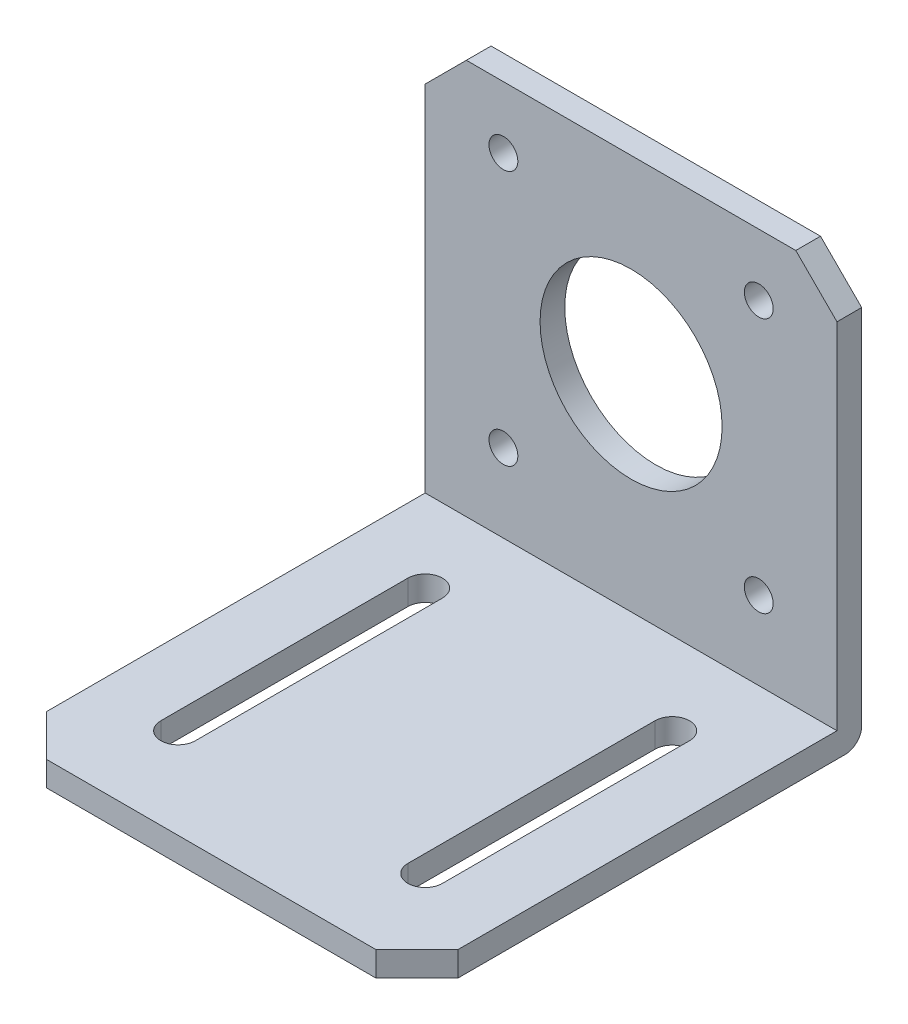
ISO-10303-21;
HEADER;
FILE_DESCRIPTION(('STEP AP214'),'2;1');
FILE_NAME('part.step','',(''),(''),'','','');
FILE_SCHEMA(('AUTOMOTIVE_DESIGN { 1 0 10303 214 1 1 1 1 }'));
ENDSEC;
DATA;
#1=APPLICATION_CONTEXT('core data for automotive mechanical design processes');
#2=APPLICATION_PROTOCOL_DEFINITION('international standard','automotive_design',2000,#1);
#3=PRODUCT_CONTEXT('',#1,'mechanical');
#4=PRODUCT('Part','Part','',(#3));
#5=PRODUCT_RELATED_PRODUCT_CATEGORY('part','',(#4));
#6=PRODUCT_DEFINITION_FORMATION('','',#4);
#7=PRODUCT_DEFINITION_CONTEXT('part definition',#1,'design');
#8=PRODUCT_DEFINITION('design','',#6,#7);
#9=PRODUCT_DEFINITION_SHAPE('','',#8);
#10=(LENGTH_UNIT() NAMED_UNIT(*) SI_UNIT(.MILLI.,.METRE.));
#11=(NAMED_UNIT(*) PLANE_ANGLE_UNIT() SI_UNIT($,.RADIAN.));
#12=(NAMED_UNIT(*) SI_UNIT($,.STERADIAN.) SOLID_ANGLE_UNIT());
#13=UNCERTAINTY_MEASURE_WITH_UNIT(LENGTH_MEASURE(1.E-05),#10,'distance_accuracy_value','');
#14=(GEOMETRIC_REPRESENTATION_CONTEXT(3) GLOBAL_UNCERTAINTY_ASSIGNED_CONTEXT((#13)) GLOBAL_UNIT_ASSIGNED_CONTEXT((#10,
#11,#12)) REPRESENTATION_CONTEXT('',''));
#15=CARTESIAN_POINT('',(0.,0.,0.));
#16=DIRECTION('',(0.,0.,1.));
#17=DIRECTION('',(1.,0.,0.));
#18=AXIS2_PLACEMENT_3D('',#15,#16,#17);
#19=CARTESIAN_POINT('',(0.,0.,3.));
#20=DIRECTION('',(0.,0.,-1.));
#21=DIRECTION('',(-1.,0.,0.));
#22=AXIS2_PLACEMENT_3D('',#19,#20,#21);
#23=PLANE('',#22);
#24=CARTESIAN_POINT('',(0.,11.7086800216875,3.));
#25=DIRECTION('',(0.,0.,1.));
#26=DIRECTION('',(1.,0.,0.));
#27=AXIS2_PLACEMENT_3D('',#24,#25,#26);
#28=CIRCLE('',#27,11.05);
#29=CARTESIAN_POINT('',(11.05,11.7086800216875,3.));
#30=VERTEX_POINT('',#29);
#31=EDGE_CURVE('E256',#30,#30,#28,.T.);
#32=ORIENTED_EDGE('',*,*,#31,.F.);
#33=EDGE_LOOP('',(#32));
#34=FACE_BOUND('',#33,.T.);
#35=CARTESIAN_POINT('',(15.5,-3.79131997831251,3.));
#36=DIRECTION('',(0.,0.,1.));
#37=DIRECTION('',(1.,0.,0.));
#38=AXIS2_PLACEMENT_3D('',#35,#36,#37);
#39=CIRCLE('',#38,1.75);
#40=CARTESIAN_POINT('',(17.25,-3.79131997831251,3.));
#41=VERTEX_POINT('',#40);
#42=EDGE_CURVE('E262',#41,#41,#39,.T.);
#43=ORIENTED_EDGE('',*,*,#42,.F.);
#44=EDGE_LOOP('',(#43));
#45=FACE_BOUND('',#44,.T.);
#46=CARTESIAN_POINT('',(-15.5,-3.79131997831251,3.));
#47=DIRECTION('',(0.,0.,1.));
#48=DIRECTION('',(1.,0.,0.));
#49=AXIS2_PLACEMENT_3D('',#46,#47,#48);
#50=CIRCLE('',#49,1.75);
#51=CARTESIAN_POINT('',(-13.75,-3.79131997831251,3.));
#52=VERTEX_POINT('',#51);
#53=EDGE_CURVE('E268',#52,#52,#50,.T.);
#54=ORIENTED_EDGE('',*,*,#53,.F.);
#55=EDGE_LOOP('',(#54));
#56=FACE_BOUND('',#55,.T.);
#57=CARTESIAN_POINT('',(15.5,27.2086800216875,3.));
#58=DIRECTION('',(0.,0.,1.));
#59=DIRECTION('',(1.,0.,0.));
#60=AXIS2_PLACEMENT_3D('',#57,#58,#59);
#61=CIRCLE('',#60,1.75);
#62=CARTESIAN_POINT('',(17.25,27.2086800216875,3.));
#63=VERTEX_POINT('',#62);
#64=EDGE_CURVE('E274',#63,#63,#61,.T.);
#65=ORIENTED_EDGE('',*,*,#64,.F.);
#66=EDGE_LOOP('',(#65));
#67=FACE_BOUND('',#66,.T.);
#68=CARTESIAN_POINT('',(-15.5,27.2086800216875,3.));
#69=DIRECTION('',(0.,0.,1.));
#70=DIRECTION('',(1.,0.,0.));
#71=AXIS2_PLACEMENT_3D('',#68,#69,#70);
#72=CIRCLE('',#71,1.75);
#73=CARTESIAN_POINT('',(-13.75,27.2086800216875,3.));
#74=VERTEX_POINT('',#73);
#75=EDGE_CURVE('E280',#74,#74,#72,.T.);
#76=ORIENTED_EDGE('',*,*,#75,.F.);
#77=EDGE_LOOP('',(#76));
#78=FACE_BOUND('',#77,.T.);
#79=DIRECTION('',(-1.,0.,0.));
#80=VECTOR('',#79,1.);
#81=CARTESIAN_POINT('',(-25.,-13.2913199783125,3.));
#82=LINE('',#81,#80);
#83=CARTESIAN_POINT('',(25.,-13.2913199783125,3.));
#84=VERTEX_POINT('',#83);
#85=CARTESIAN_POINT('',(-25.,-13.2913199783125,3.));
#86=VERTEX_POINT('',#85);
#87=EDGE_CURVE('E242',#84,#86,#82,.T.);
#88=ORIENTED_EDGE('',*,*,#87,.F.);
#89=DIRECTION('',(0.,1.,0.));
#90=VECTOR('',#89,1.);
#91=CARTESIAN_POINT('',(25.,29.7086800216875,3.));
#92=LINE('',#91,#90);
#93=CARTESIAN_POINT('',(25.,29.7086800216875,3.));
#94=VERTEX_POINT('',#93);
#95=EDGE_CURVE('E286',#84,#94,#92,.T.);
#96=ORIENTED_EDGE('',*,*,#95,.T.);
#97=DIRECTION('',(-0.707106781186547,0.707106781186548,0.));
#98=VECTOR('',#97,1.);
#99=CARTESIAN_POINT('',(20.,34.7086800216875,3.));
#100=LINE('',#99,#98);
#101=CARTESIAN_POINT('',(20.,34.7086800216875,3.));
#102=VERTEX_POINT('',#101);
#103=EDGE_CURVE('E288',#94,#102,#100,.T.);
#104=ORIENTED_EDGE('',*,*,#103,.T.);
#105=DIRECTION('',(-1.,0.,0.));
#106=VECTOR('',#105,1.);
#107=CARTESIAN_POINT('',(-20.,34.7086800216875,3.));
#108=LINE('',#107,#106);
#109=CARTESIAN_POINT('',(-20.,34.7086800216875,3.));
#110=VERTEX_POINT('',#109);
#111=EDGE_CURVE('E291',#102,#110,#108,.T.);
#112=ORIENTED_EDGE('',*,*,#111,.T.);
#113=DIRECTION('',(-0.707106781186548,-0.707106781186548,0.));
#114=VECTOR('',#113,1.);
#115=CARTESIAN_POINT('',(-25.,29.7086800216875,3.));
#116=LINE('',#115,#114);
#117=CARTESIAN_POINT('',(-25.,29.7086800216875,3.));
#118=VERTEX_POINT('',#117);
#119=EDGE_CURVE('E293',#110,#118,#116,.T.);
#120=ORIENTED_EDGE('',*,*,#119,.T.);
#121=DIRECTION('',(0.,-1.,0.));
#122=VECTOR('',#121,1.);
#123=CARTESIAN_POINT('',(-25.,-16.2913199783125,3.));
#124=LINE('',#123,#122);
#125=EDGE_CURVE('E295',#118,#86,#124,.T.);
#126=ORIENTED_EDGE('',*,*,#125,.T.);
#127=EDGE_LOOP('',(#88,#96,#104,#112,#120,#126));
#128=FACE_BOUND('',#127,.T.);
#129=ADVANCED_FACE('F35',(#34,#45,#56,#67,#78,#128),#23,.F.);
#130=CARTESIAN_POINT('',(0.,0.,0.));
#131=DIRECTION('',(0.,0.,-1.));
#132=DIRECTION('',(-1.,0.,0.));
#133=AXIS2_PLACEMENT_3D('',#130,#131,#132);
#134=PLANE('',#133);
#135=CARTESIAN_POINT('',(15.5,-3.79131997831251,0.));
#136=DIRECTION('',(0.,0.,1.));
#137=DIRECTION('',(1.,0.,0.));
#138=AXIS2_PLACEMENT_3D('',#135,#136,#137);
#139=CIRCLE('',#138,1.75);
#140=CARTESIAN_POINT('',(17.25,-3.79131997831251,0.));
#141=VERTEX_POINT('',#140);
#142=EDGE_CURVE('E259',#141,#141,#139,.T.);
#143=ORIENTED_EDGE('',*,*,#142,.T.);
#144=EDGE_LOOP('',(#143));
#145=FACE_BOUND('',#144,.T.);
#146=CARTESIAN_POINT('',(15.5,27.2086800216875,0.));
#147=DIRECTION('',(0.,0.,1.));
#148=DIRECTION('',(1.,0.,0.));
#149=AXIS2_PLACEMENT_3D('',#146,#147,#148);
#150=CIRCLE('',#149,1.75);
#151=CARTESIAN_POINT('',(17.25,27.2086800216875,0.));
#152=VERTEX_POINT('',#151);
#153=EDGE_CURVE('E271',#152,#152,#150,.T.);
#154=ORIENTED_EDGE('',*,*,#153,.T.);
#155=EDGE_LOOP('',(#154));
#156=FACE_BOUND('',#155,.T.);
#157=DIRECTION('',(0.,1.,0.));
#158=VECTOR('',#157,1.);
#159=CARTESIAN_POINT('',(25.,29.7086800216875,0.));
#160=LINE('',#159,#158);
#161=CARTESIAN_POINT('',(25.,-14.2913199783125,0.));
#162=VERTEX_POINT('',#161);
#163=CARTESIAN_POINT('',(25.,29.7086800216875,0.));
#164=VERTEX_POINT('',#163);
#165=EDGE_CURVE('E283',#162,#164,#160,.T.);
#166=ORIENTED_EDGE('',*,*,#165,.F.);
#167=DIRECTION('',(1.,0.,0.));
#168=VECTOR('',#167,1.);
#169=CARTESIAN_POINT('',(-25.,-14.2913199783125,0.));
#170=LINE('',#169,#168);
#171=CARTESIAN_POINT('',(-25.,-14.2913199783125,0.));
#172=VERTEX_POINT('',#171);
#173=EDGE_CURVE('E328',#162,#172,#170,.F.);
#174=ORIENTED_EDGE('',*,*,#173,.T.);
#175=DIRECTION('',(0.,-1.,0.));
#176=VECTOR('',#175,1.);
#177=CARTESIAN_POINT('',(-25.,-16.2913199783125,0.));
#178=LINE('',#177,#176);
#179=CARTESIAN_POINT('',(-25.,29.7086800216875,0.));
#180=VERTEX_POINT('',#179);
#181=EDGE_CURVE('E289',#180,#172,#178,.T.);
#182=ORIENTED_EDGE('',*,*,#181,.F.);
#183=DIRECTION('',(-0.707106781186548,-0.707106781186548,0.));
#184=VECTOR('',#183,1.);
#185=CARTESIAN_POINT('',(-25.,29.7086800216875,0.));
#186=LINE('',#185,#184);
#187=CARTESIAN_POINT('',(-20.,34.7086800216875,0.));
#188=VERTEX_POINT('',#187);
#189=EDGE_CURVE('E304',#188,#180,#186,.T.);
#190=ORIENTED_EDGE('',*,*,#189,.F.);
#191=DIRECTION('',(-1.,0.,0.));
#192=VECTOR('',#191,1.);
#193=CARTESIAN_POINT('',(-20.,34.7086800216875,0.));
#194=LINE('',#193,#192);
#195=CARTESIAN_POINT('',(20.,34.7086800216875,0.));
#196=VERTEX_POINT('',#195);
#197=EDGE_CURVE('E302',#196,#188,#194,.T.);
#198=ORIENTED_EDGE('',*,*,#197,.F.);
#199=DIRECTION('',(-0.707106781186547,0.707106781186548,0.));
#200=VECTOR('',#199,1.);
#201=CARTESIAN_POINT('',(20.,34.7086800216875,0.));
#202=LINE('',#201,#200);
#203=EDGE_CURVE('E300',#164,#196,#202,.T.);
#204=ORIENTED_EDGE('',*,*,#203,.F.);
#205=EDGE_LOOP('',(#166,#174,#182,#190,#198,#204));
#206=FACE_BOUND('',#205,.T.);
#207=CARTESIAN_POINT('',(-15.5,27.2086800216875,0.));
#208=DIRECTION('',(0.,0.,1.));
#209=DIRECTION('',(1.,0.,0.));
#210=AXIS2_PLACEMENT_3D('',#207,#208,#209);
#211=CIRCLE('',#210,1.75);
#212=CARTESIAN_POINT('',(-13.75,27.2086800216875,0.));
#213=VERTEX_POINT('',#212);
#214=EDGE_CURVE('E277',#213,#213,#211,.T.);
#215=ORIENTED_EDGE('',*,*,#214,.T.);
#216=EDGE_LOOP('',(#215));
#217=FACE_BOUND('',#216,.T.);
#218=CARTESIAN_POINT('',(-15.5,-3.79131997831251,0.));
#219=DIRECTION('',(0.,0.,1.));
#220=DIRECTION('',(1.,0.,0.));
#221=AXIS2_PLACEMENT_3D('',#218,#219,#220);
#222=CIRCLE('',#221,1.75);
#223=CARTESIAN_POINT('',(-13.75,-3.79131997831251,0.));
#224=VERTEX_POINT('',#223);
#225=EDGE_CURVE('E265',#224,#224,#222,.T.);
#226=ORIENTED_EDGE('',*,*,#225,.T.);
#227=EDGE_LOOP('',(#226));
#228=FACE_BOUND('',#227,.T.);
#229=CARTESIAN_POINT('',(0.,11.7086800216875,0.));
#230=DIRECTION('',(0.,0.,1.));
#231=DIRECTION('',(1.,0.,0.));
#232=AXIS2_PLACEMENT_3D('',#229,#230,#231);
#233=CIRCLE('',#232,11.05);
#234=CARTESIAN_POINT('',(11.05,11.7086800216875,0.));
#235=VERTEX_POINT('',#234);
#236=EDGE_CURVE('E255',#235,#235,#233,.T.);
#237=ORIENTED_EDGE('',*,*,#236,.T.);
#238=EDGE_LOOP('',(#237));
#239=FACE_BOUND('',#238,.T.);
#240=ADVANCED_FACE('F379',(#145,#156,#206,#217,#228,#239),#134,.T.);
#241=CARTESIAN_POINT('',(25.,-16.2913199783125,3.));
#242=DIRECTION('',(0.,1.,0.));
#243=DIRECTION('',(-1.,0.,0.));
#244=AXIS2_PLACEMENT_3D('',#241,#242,#243);
#245=PLANE('',#244);
#246=DIRECTION('',(0.,0.,-1.));
#247=VECTOR('',#246,1.);
#248=CARTESIAN_POINT('',(17.1,-16.2913199783125,3.));
#249=LINE('',#248,#247);
#250=CARTESIAN_POINT('',(17.1,-16.2913199783125,43.));
#251=VERTEX_POINT('',#250);
#252=CARTESIAN_POINT('',(17.1,-16.2913199783125,13.));
#253=VERTEX_POINT('',#252);
#254=EDGE_CURVE('E204',#251,#253,#249,.T.);
#255=ORIENTED_EDGE('',*,*,#254,.T.);
#256=CARTESIAN_POINT('',(15.,-16.2913199783125,13.));
#257=DIRECTION('',(0.,1.,0.));
#258=DIRECTION('',(-1.,0.,0.));
#259=AXIS2_PLACEMENT_3D('',#256,#257,#258);
#260=CIRCLE('',#259,2.1);
#261=CARTESIAN_POINT('',(12.9,-16.2913199783125,13.));
#262=VERTEX_POINT('',#261);
#263=EDGE_CURVE('E207',#253,#262,#260,.T.);
#264=ORIENTED_EDGE('',*,*,#263,.T.);
#265=DIRECTION('',(0.,0.,1.));
#266=VECTOR('',#265,1.);
#267=CARTESIAN_POINT('',(12.9,-16.2913199783125,3.));
#268=LINE('',#267,#266);
#269=CARTESIAN_POINT('',(12.9,-16.2913199783125,43.));
#270=VERTEX_POINT('',#269);
#271=EDGE_CURVE('E199',#262,#270,#268,.T.);
#272=ORIENTED_EDGE('',*,*,#271,.T.);
#273=CARTESIAN_POINT('',(15.,-16.2913199783125,43.));
#274=DIRECTION('',(0.,1.,0.));
#275=DIRECTION('',(-1.,0.,0.));
#276=AXIS2_PLACEMENT_3D('',#273,#274,#275);
#277=CIRCLE('',#276,2.1);
#278=EDGE_CURVE('E174',#270,#251,#277,.T.);
#279=ORIENTED_EDGE('',*,*,#278,.T.);
#280=EDGE_LOOP('',(#255,#264,#272,#279));
#281=FACE_BOUND('',#280,.T.);
#282=DIRECTION('',(0.,0.,-1.));
#283=VECTOR('',#282,1.);
#284=CARTESIAN_POINT('',(-12.9,-16.2913199783125,2.99999999999999));
#285=LINE('',#284,#283);
#286=CARTESIAN_POINT('',(-12.9,-16.2913199783125,43.));
#287=VERTEX_POINT('',#286);
#288=CARTESIAN_POINT('',(-12.9,-16.2913199783125,13.));
#289=VERTEX_POINT('',#288);
#290=EDGE_CURVE('E236',#287,#289,#285,.T.);
#291=ORIENTED_EDGE('',*,*,#290,.T.);
#292=CARTESIAN_POINT('',(-15.,-16.2913199783125,13.));
#293=DIRECTION('',(0.,1.,0.));
#294=DIRECTION('',(-1.,0.,0.));
#295=AXIS2_PLACEMENT_3D('',#292,#293,#294);
#296=CIRCLE('',#295,2.1);
#297=CARTESIAN_POINT('',(-17.1,-16.2913199783125,13.));
#298=VERTEX_POINT('',#297);
#299=EDGE_CURVE('E239',#289,#298,#296,.T.);
#300=ORIENTED_EDGE('',*,*,#299,.T.);
#301=DIRECTION('',(0.,0.,1.));
#302=VECTOR('',#301,1.);
#303=CARTESIAN_POINT('',(-17.1,-16.2913199783125,2.99999999999999));
#304=LINE('',#303,#302);
#305=CARTESIAN_POINT('',(-17.1,-16.2913199783125,43.));
#306=VERTEX_POINT('',#305);
#307=EDGE_CURVE('E224',#298,#306,#304,.T.);
#308=ORIENTED_EDGE('',*,*,#307,.T.);
#309=CARTESIAN_POINT('',(-15.,-16.2913199783125,43.));
#310=DIRECTION('',(0.,1.,0.));
#311=DIRECTION('',(-1.,0.,0.));
#312=AXIS2_PLACEMENT_3D('',#309,#310,#311);
#313=CIRCLE('',#312,2.1);
#314=EDGE_CURVE('E233',#306,#287,#313,.T.);
#315=ORIENTED_EDGE('',*,*,#314,.T.);
#316=EDGE_LOOP('',(#291,#300,#308,#315));
#317=FACE_BOUND('',#316,.T.);
#318=DIRECTION('',(1.,0.,0.));
#319=VECTOR('',#318,1.);
#320=CARTESIAN_POINT('',(-25.,-16.2913199783125,54.));
#321=LINE('',#320,#319);
#322=CARTESIAN_POINT('',(-20.,-16.2913199783125,54.));
#323=VERTEX_POINT('',#322);
#324=CARTESIAN_POINT('',(20.,-16.2913199783125,54.));
#325=VERTEX_POINT('',#324);
#326=EDGE_CURVE('E243',#323,#325,#321,.T.);
#327=ORIENTED_EDGE('',*,*,#326,.F.);
#328=DIRECTION('',(-0.707106781186546,0.,-0.70710678118655));
#329=VECTOR('',#328,1.);
#330=CARTESIAN_POINT('',(-20.,-16.2913199783125,54.));
#331=LINE('',#330,#329);
#332=CARTESIAN_POINT('',(-25.,-16.2913199783125,49.));
#333=VERTEX_POINT('',#332);
#334=EDGE_CURVE('E341',#323,#333,#331,.T.);
#335=ORIENTED_EDGE('',*,*,#334,.T.);
#336=DIRECTION('',(0.,0.,-1.));
#337=VECTOR('',#336,1.);
#338=CARTESIAN_POINT('',(-25.,-16.2913199783125,3.));
#339=LINE('',#338,#337);
#340=CARTESIAN_POINT('',(-25.,-16.2913199783125,2.));
#341=VERTEX_POINT('',#340);
#342=EDGE_CURVE('E298',#333,#341,#339,.T.);
#343=ORIENTED_EDGE('',*,*,#342,.T.);
#344=DIRECTION('',(1.,0.,0.));
#345=VECTOR('',#344,1.);
#346=CARTESIAN_POINT('',(25.,-16.2913199783125,2.));
#347=LINE('',#346,#345);
#348=CARTESIAN_POINT('',(25.,-16.2913199783125,2.));
#349=VERTEX_POINT('',#348);
#350=EDGE_CURVE('E323',#341,#349,#347,.T.);
#351=ORIENTED_EDGE('',*,*,#350,.T.);
#352=DIRECTION('',(0.,0.,-1.));
#353=VECTOR('',#352,1.);
#354=CARTESIAN_POINT('',(25.,-16.2913199783125,3.));
#355=LINE('',#354,#353);
#356=CARTESIAN_POINT('',(25.,-16.2913199783125,49.));
#357=VERTEX_POINT('',#356);
#358=EDGE_CURVE('E321',#357,#349,#355,.T.);
#359=ORIENTED_EDGE('',*,*,#358,.F.);
#360=DIRECTION('',(-0.707106781186546,0.,0.707106781186549));
#361=VECTOR('',#360,1.);
#362=CARTESIAN_POINT('',(20.,-16.2913199783125,54.));
#363=LINE('',#362,#361);
#364=EDGE_CURVE('E339',#357,#325,#363,.T.);
#365=ORIENTED_EDGE('',*,*,#364,.T.);
#366=EDGE_LOOP('',(#327,#335,#343,#351,#359,#365));
#367=FACE_BOUND('',#366,.T.);
#368=ADVANCED_FACE('F353',(#281,#317,#367),#245,.F.);
#369=CARTESIAN_POINT('',(25.,29.7086800216875,3.));
#370=DIRECTION('',(-1.,0.,0.));
#371=DIRECTION('',(0.,-1.,0.));
#372=AXIS2_PLACEMENT_3D('',#369,#370,#371);
#373=PLANE('',#372);
#374=DIRECTION('',(0.,0.,-1.));
#375=VECTOR('',#374,1.);
#376=CARTESIAN_POINT('',(25.,-13.2913199783125,54.));
#377=LINE('',#376,#375);
#378=CARTESIAN_POINT('',(25.,-13.2913199783125,49.));
#379=VERTEX_POINT('',#378);
#380=EDGE_CURVE('E253',#379,#84,#377,.T.);
#381=ORIENTED_EDGE('',*,*,#380,.F.);
#382=DIRECTION('',(0.,-1.,0.));
#383=VECTOR('',#382,1.);
#384=CARTESIAN_POINT('',(25.,-16.2913199783125,49.));
#385=LINE('',#384,#383);
#386=EDGE_CURVE('E11',#379,#357,#385,.T.);
#387=ORIENTED_EDGE('',*,*,#386,.T.);
#388=ORIENTED_EDGE('',*,*,#358,.T.);
#389=CARTESIAN_POINT('',(25.,-14.2913199783125,2.));
#390=DIRECTION('',(-1.,0.,0.));
#391=DIRECTION('',(0.,-1.,0.));
#392=AXIS2_PLACEMENT_3D('',#389,#390,#391);
#393=CIRCLE('',#392,2.);
#394=EDGE_CURVE('E326',#349,#162,#393,.F.);
#395=ORIENTED_EDGE('',*,*,#394,.T.);
#396=ORIENTED_EDGE('',*,*,#165,.T.);
#397=DIRECTION('',(0.,0.,-1.));
#398=VECTOR('',#397,1.);
#399=CARTESIAN_POINT('',(25.,29.7086800216875,3.));
#400=LINE('',#399,#398);
#401=EDGE_CURVE('E318',#94,#164,#400,.T.);
#402=ORIENTED_EDGE('',*,*,#401,.F.);
#403=ORIENTED_EDGE('',*,*,#95,.F.);
#404=EDGE_LOOP('',(#381,#387,#388,#395,#396,#402,#403));
#405=FACE_BOUND('',#404,.T.);
#406=ADVANCED_FACE('F367',(#405),#373,.F.);
#407=CARTESIAN_POINT('',(20.,34.7086800216875,3.));
#408=DIRECTION('',(-0.707106781186548,-0.707106781186547,0.));
#409=DIRECTION('',(0.707106781186547,-0.707106781186548,0.));
#410=AXIS2_PLACEMENT_3D('',#407,#408,#409);
#411=PLANE('',#410);
#412=ORIENTED_EDGE('',*,*,#203,.T.);
#413=DIRECTION('',(0.,0.,-1.));
#414=VECTOR('',#413,1.);
#415=CARTESIAN_POINT('',(20.,34.7086800216875,3.));
#416=LINE('',#415,#414);
#417=EDGE_CURVE('E315',#102,#196,#416,.T.);
#418=ORIENTED_EDGE('',*,*,#417,.F.);
#419=ORIENTED_EDGE('',*,*,#103,.F.);
#420=ORIENTED_EDGE('',*,*,#401,.T.);
#421=EDGE_LOOP('',(#412,#418,#419,#420));
#422=FACE_BOUND('',#421,.T.);
#423=ADVANCED_FACE('F385',(#422),#411,.F.);
#424=CARTESIAN_POINT('',(-20.,34.7086800216875,3.));
#425=DIRECTION('',(0.,-1.,0.));
#426=DIRECTION('',(1.,0.,0.));
#427=AXIS2_PLACEMENT_3D('',#424,#425,#426);
#428=PLANE('',#427);
#429=ORIENTED_EDGE('',*,*,#197,.T.);
#430=DIRECTION('',(0.,0.,-1.));
#431=VECTOR('',#430,1.);
#432=CARTESIAN_POINT('',(-20.,34.7086800216875,3.));
#433=LINE('',#432,#431);
#434=EDGE_CURVE('E312',#110,#188,#433,.T.);
#435=ORIENTED_EDGE('',*,*,#434,.F.);
#436=ORIENTED_EDGE('',*,*,#111,.F.);
#437=ORIENTED_EDGE('',*,*,#417,.T.);
#438=EDGE_LOOP('',(#429,#435,#436,#437));
#439=FACE_BOUND('',#438,.T.);
#440=ADVANCED_FACE('F390',(#439),#428,.F.);
#441=CARTESIAN_POINT('',(-25.,29.7086800216875,3.));
#442=DIRECTION('',(0.707106781186547,-0.707106781186547,0.));
#443=DIRECTION('',(0.707106781186548,0.707106781186548,0.));
#444=AXIS2_PLACEMENT_3D('',#441,#442,#443);
#445=PLANE('',#444);
#446=ORIENTED_EDGE('',*,*,#189,.T.);
#447=DIRECTION('',(0.,0.,-1.));
#448=VECTOR('',#447,1.);
#449=CARTESIAN_POINT('',(-25.,29.7086800216875,3.));
#450=LINE('',#449,#448);
#451=EDGE_CURVE('E309',#118,#180,#450,.T.);
#452=ORIENTED_EDGE('',*,*,#451,.F.);
#453=ORIENTED_EDGE('',*,*,#119,.F.);
#454=ORIENTED_EDGE('',*,*,#434,.T.);
#455=EDGE_LOOP('',(#446,#452,#453,#454));
#456=FACE_BOUND('',#455,.T.);
#457=ADVANCED_FACE('F391',(#456),#445,.F.);
#458=CARTESIAN_POINT('',(-25.,-16.2913199783125,3.));
#459=DIRECTION('',(1.,0.,0.));
#460=DIRECTION('',(0.,1.,0.));
#461=AXIS2_PLACEMENT_3D('',#458,#459,#460);
#462=PLANE('',#461);
#463=ORIENTED_EDGE('',*,*,#342,.F.);
#464=DIRECTION('',(0.,1.,0.));
#465=VECTOR('',#464,1.);
#466=CARTESIAN_POINT('',(-25.,-13.2913199783125,49.));
#467=LINE('',#466,#465);
#468=CARTESIAN_POINT('',(-25.,-13.2913199783125,49.));
#469=VERTEX_POINT('',#468);
#470=EDGE_CURVE('E58',#333,#469,#467,.T.);
#471=ORIENTED_EDGE('',*,*,#470,.T.);
#472=DIRECTION('',(0.,0.,-1.));
#473=VECTOR('',#472,1.);
#474=CARTESIAN_POINT('',(-25.,-13.2913199783125,54.));
#475=LINE('',#474,#473);
#476=EDGE_CURVE('E249',#469,#86,#475,.T.);
#477=ORIENTED_EDGE('',*,*,#476,.T.);
#478=ORIENTED_EDGE('',*,*,#125,.F.);
#479=ORIENTED_EDGE('',*,*,#451,.T.);
#480=ORIENTED_EDGE('',*,*,#181,.T.);
#481=CARTESIAN_POINT('',(-25.,-14.2913199783125,2.));
#482=DIRECTION('',(1.,0.,0.));
#483=DIRECTION('',(0.,1.,0.));
#484=AXIS2_PLACEMENT_3D('',#481,#482,#483);
#485=CIRCLE('',#484,2.);
#486=EDGE_CURVE('E330',#172,#341,#485,.F.);
#487=ORIENTED_EDGE('',*,*,#486,.T.);
#488=EDGE_LOOP('',(#463,#471,#477,#478,#479,#480,#487));
#489=FACE_BOUND('',#488,.T.);
#490=ADVANCED_FACE('F354',(#489),#462,.F.);
#491=CARTESIAN_POINT('',(-15.5,27.2086800216875,3.));
#492=DIRECTION('',(0.,0.,-1.));
#493=DIRECTION('',(-1.,0.,0.));
#494=AXIS2_PLACEMENT_3D('',#491,#492,#493);
#495=CYLINDRICAL_SURFACE('',#494,1.75);
#496=ORIENTED_EDGE('',*,*,#75,.T.);
#497=EDGE_LOOP('',(#496));
#498=FACE_BOUND('',#497,.T.);
#499=ORIENTED_EDGE('',*,*,#214,.F.);
#500=EDGE_LOOP('',(#499));
#501=FACE_BOUND('',#500,.T.);
#502=ADVANCED_FACE('F398',(#498,#501),#495,.F.);
#503=CARTESIAN_POINT('',(15.5,27.2086800216875,3.));
#504=DIRECTION('',(0.,0.,-1.));
#505=DIRECTION('',(-1.,0.,0.));
#506=AXIS2_PLACEMENT_3D('',#503,#504,#505);
#507=CYLINDRICAL_SURFACE('',#506,1.75);
#508=ORIENTED_EDGE('',*,*,#64,.T.);
#509=EDGE_LOOP('',(#508));
#510=FACE_BOUND('',#509,.T.);
#511=ORIENTED_EDGE('',*,*,#153,.F.);
#512=EDGE_LOOP('',(#511));
#513=FACE_BOUND('',#512,.T.);
#514=ADVANCED_FACE('F414',(#510,#513),#507,.F.);
#515=CARTESIAN_POINT('',(-15.5,-3.79131997831251,3.));
#516=DIRECTION('',(0.,0.,-1.));
#517=DIRECTION('',(-1.,0.,0.));
#518=AXIS2_PLACEMENT_3D('',#515,#516,#517);
#519=CYLINDRICAL_SURFACE('',#518,1.75);
#520=ORIENTED_EDGE('',*,*,#53,.T.);
#521=EDGE_LOOP('',(#520));
#522=FACE_BOUND('',#521,.T.);
#523=ORIENTED_EDGE('',*,*,#225,.F.);
#524=EDGE_LOOP('',(#523));
#525=FACE_BOUND('',#524,.T.);
#526=ADVANCED_FACE('F418',(#522,#525),#519,.F.);
#527=CARTESIAN_POINT('',(15.5,-3.79131997831251,3.));
#528=DIRECTION('',(0.,0.,-1.));
#529=DIRECTION('',(-1.,0.,0.));
#530=AXIS2_PLACEMENT_3D('',#527,#528,#529);
#531=CYLINDRICAL_SURFACE('',#530,1.75);
#532=ORIENTED_EDGE('',*,*,#42,.T.);
#533=EDGE_LOOP('',(#532));
#534=FACE_BOUND('',#533,.T.);
#535=ORIENTED_EDGE('',*,*,#142,.F.);
#536=EDGE_LOOP('',(#535));
#537=FACE_BOUND('',#536,.T.);
#538=ADVANCED_FACE('F422',(#534,#537),#531,.F.);
#539=CARTESIAN_POINT('',(0.,11.7086800216875,3.));
#540=DIRECTION('',(0.,0.,-1.));
#541=DIRECTION('',(-1.,0.,0.));
#542=AXIS2_PLACEMENT_3D('',#539,#540,#541);
#543=CYLINDRICAL_SURFACE('',#542,11.05);
#544=ORIENTED_EDGE('',*,*,#31,.T.);
#545=EDGE_LOOP('',(#544));
#546=FACE_BOUND('',#545,.T.);
#547=ORIENTED_EDGE('',*,*,#236,.F.);
#548=EDGE_LOOP('',(#547));
#549=FACE_BOUND('',#548,.T.);
#550=ADVANCED_FACE('F426',(#546,#549),#543,.F.);
#551=CARTESIAN_POINT('',(-25.,-13.2913199783125,54.));
#552=DIRECTION('',(0.,-1.,0.));
#553=DIRECTION('',(1.,0.,0.));
#554=AXIS2_PLACEMENT_3D('',#551,#552,#553);
#555=PLANE('',#554);
#556=DIRECTION('',(0.,0.,1.));
#557=VECTOR('',#556,1.);
#558=CARTESIAN_POINT('',(12.9,-13.2913199783125,13.));
#559=LINE('',#558,#557);
#560=CARTESIAN_POINT('',(12.9,-13.2913199783125,13.));
#561=VERTEX_POINT('',#560);
#562=CARTESIAN_POINT('',(12.9,-13.2913199783125,43.));
#563=VERTEX_POINT('',#562);
#564=EDGE_CURVE('E182',#561,#563,#559,.T.);
#565=ORIENTED_EDGE('',*,*,#564,.F.);
#566=CARTESIAN_POINT('',(15.,-13.2913199783125,13.));
#567=DIRECTION('',(0.,1.,0.));
#568=DIRECTION('',(0.,0.,1.));
#569=AXIS2_PLACEMENT_3D('',#566,#567,#568);
#570=CIRCLE('',#569,2.1);
#571=CARTESIAN_POINT('',(17.1,-13.2913199783125,13.));
#572=VERTEX_POINT('',#571);
#573=EDGE_CURVE('E187',#572,#561,#570,.T.);
#574=ORIENTED_EDGE('',*,*,#573,.F.);
#575=DIRECTION('',(0.,0.,-1.));
#576=VECTOR('',#575,1.);
#577=CARTESIAN_POINT('',(17.1,-13.2913199783125,13.));
#578=LINE('',#577,#576);
#579=CARTESIAN_POINT('',(17.1,-13.2913199783125,43.));
#580=VERTEX_POINT('',#579);
#581=EDGE_CURVE('E192',#580,#572,#578,.T.);
#582=ORIENTED_EDGE('',*,*,#581,.F.);
#583=CARTESIAN_POINT('',(15.,-13.2913199783125,43.));
#584=DIRECTION('',(0.,1.,0.));
#585=DIRECTION('',(0.,0.,1.));
#586=AXIS2_PLACEMENT_3D('',#583,#584,#585);
#587=CIRCLE('',#586,2.1);
#588=EDGE_CURVE('E171',#563,#580,#587,.T.);
#589=ORIENTED_EDGE('',*,*,#588,.F.);
#590=EDGE_LOOP('',(#565,#574,#582,#589));
#591=FACE_BOUND('',#590,.T.);
#592=DIRECTION('',(0.,0.,1.));
#593=VECTOR('',#592,1.);
#594=CARTESIAN_POINT('',(-17.1,-13.2913199783125,13.));
#595=LINE('',#594,#593);
#596=CARTESIAN_POINT('',(-17.1,-13.2913199783125,13.));
#597=VERTEX_POINT('',#596);
#598=CARTESIAN_POINT('',(-17.1,-13.2913199783125,43.));
#599=VERTEX_POINT('',#598);
#600=EDGE_CURVE('E212',#597,#599,#595,.T.);
#601=ORIENTED_EDGE('',*,*,#600,.F.);
#602=CARTESIAN_POINT('',(-15.,-13.2913199783125,13.));
#603=DIRECTION('',(0.,1.,0.));
#604=DIRECTION('',(0.,0.,1.));
#605=AXIS2_PLACEMENT_3D('',#602,#603,#604);
#606=CIRCLE('',#605,2.1);
#607=CARTESIAN_POINT('',(-12.9,-13.2913199783125,13.));
#608=VERTEX_POINT('',#607);
#609=EDGE_CURVE('E210',#608,#597,#606,.T.);
#610=ORIENTED_EDGE('',*,*,#609,.F.);
#611=DIRECTION('',(0.,0.,-1.));
#612=VECTOR('',#611,1.);
#613=CARTESIAN_POINT('',(-12.9,-13.2913199783125,43.));
#614=LINE('',#613,#612);
#615=CARTESIAN_POINT('',(-12.9,-13.2913199783125,43.));
#616=VERTEX_POINT('',#615);
#617=EDGE_CURVE('E218',#616,#608,#614,.T.);
#618=ORIENTED_EDGE('',*,*,#617,.F.);
#619=CARTESIAN_POINT('',(-15.,-13.2913199783125,43.));
#620=DIRECTION('',(0.,1.,0.));
#621=DIRECTION('',(0.,0.,1.));
#622=AXIS2_PLACEMENT_3D('',#619,#620,#621);
#623=CIRCLE('',#622,2.1);
#624=EDGE_CURVE('E215',#599,#616,#623,.T.);
#625=ORIENTED_EDGE('',*,*,#624,.F.);
#626=EDGE_LOOP('',(#601,#610,#618,#625));
#627=FACE_BOUND('',#626,.T.);
#628=ORIENTED_EDGE('',*,*,#476,.F.);
#629=DIRECTION('',(0.707106781186546,0.,0.70710678118655));
#630=VECTOR('',#629,1.);
#631=CARTESIAN_POINT('',(-20.,-13.2913199783125,54.));
#632=LINE('',#631,#630);
#633=CARTESIAN_POINT('',(-20.,-13.2913199783125,54.));
#634=VERTEX_POINT('',#633);
#635=EDGE_CURVE('E43',#469,#634,#632,.T.);
#636=ORIENTED_EDGE('',*,*,#635,.T.);
#637=DIRECTION('',(-1.,0.,0.));
#638=VECTOR('',#637,1.);
#639=CARTESIAN_POINT('',(-25.,-13.2913199783125,54.));
#640=LINE('',#639,#638);
#641=CARTESIAN_POINT('',(20.,-13.2913199783125,54.));
#642=VERTEX_POINT('',#641);
#643=EDGE_CURVE('E246',#642,#634,#640,.T.);
#644=ORIENTED_EDGE('',*,*,#643,.F.);
#645=DIRECTION('',(0.707106781186546,0.,-0.707106781186549));
#646=VECTOR('',#645,1.);
#647=CARTESIAN_POINT('',(20.,-13.2913199783125,54.));
#648=LINE('',#647,#646);
#649=EDGE_CURVE('E50',#642,#379,#648,.T.);
#650=ORIENTED_EDGE('',*,*,#649,.T.);
#651=ORIENTED_EDGE('',*,*,#380,.T.);
#652=ORIENTED_EDGE('',*,*,#87,.T.);
#653=EDGE_LOOP('',(#628,#636,#644,#650,#651,#652));
#654=FACE_BOUND('',#653,.T.);
#655=ADVANCED_FACE('F189',(#591,#627,#654),#555,.F.);
#656=CARTESIAN_POINT('',(0.,0.,54.));
#657=DIRECTION('',(0.,0.,1.));
#658=DIRECTION('',(1.,0.,0.));
#659=AXIS2_PLACEMENT_3D('',#656,#657,#658);
#660=PLANE('',#659);
#661=ORIENTED_EDGE('',*,*,#643,.T.);
#662=DIRECTION('',(0.,-1.,0.));
#663=VECTOR('',#662,1.);
#664=CARTESIAN_POINT('',(-20.,-16.2913199783125,54.));
#665=LINE('',#664,#663);
#666=EDGE_CURVE('E336',#634,#323,#665,.T.);
#667=ORIENTED_EDGE('',*,*,#666,.T.);
#668=ORIENTED_EDGE('',*,*,#326,.T.);
#669=DIRECTION('',(0.,1.,0.));
#670=VECTOR('',#669,1.);
#671=CARTESIAN_POINT('',(20.,-13.2913199783125,54.));
#672=LINE('',#671,#670);
#673=EDGE_CURVE('E333',#325,#642,#672,.T.);
#674=ORIENTED_EDGE('',*,*,#673,.T.);
#675=EDGE_LOOP('',(#661,#667,#668,#674));
#676=FACE_BOUND('',#675,.T.);
#677=ADVANCED_FACE('F348',(#676),#660,.T.);
#678=CARTESIAN_POINT('',(25.,-14.2913199783125,2.));
#679=DIRECTION('',(-1.,0.,0.));
#680=DIRECTION('',(0.,-1.,0.));
#681=AXIS2_PLACEMENT_3D('',#678,#679,#680);
#682=CYLINDRICAL_SURFACE('',#681,2.);
#683=ORIENTED_EDGE('',*,*,#486,.F.);
#684=ORIENTED_EDGE('',*,*,#173,.F.);
#685=ORIENTED_EDGE('',*,*,#394,.F.);
#686=ORIENTED_EDGE('',*,*,#350,.F.);
#687=EDGE_LOOP('',(#683,#684,#685,#686));
#688=FACE_BOUND('',#687,.T.);
#689=ADVANCED_FACE('F361',(#688),#682,.T.);
#690=CARTESIAN_POINT('',(-15.,-64.2913199783125,13.));
#691=DIRECTION('',(0.,1.,0.));
#692=DIRECTION('',(0.,0.,1.));
#693=AXIS2_PLACEMENT_3D('',#690,#691,#692);
#694=CYLINDRICAL_SURFACE('',#693,2.1);
#695=DIRECTION('',(0.,1.,0.));
#696=VECTOR('',#695,1.);
#697=CARTESIAN_POINT('',(-12.9,-64.2913199783125,13.));
#698=LINE('',#697,#696);
#699=EDGE_CURVE('E222',#289,#608,#698,.T.);
#700=ORIENTED_EDGE('',*,*,#699,.T.);
#701=ORIENTED_EDGE('',*,*,#609,.T.);
#702=DIRECTION('',(0.,1.,0.));
#703=VECTOR('',#702,1.);
#704=CARTESIAN_POINT('',(-17.1,-64.2913199783125,13.));
#705=LINE('',#704,#703);
#706=EDGE_CURVE('E221',#298,#597,#705,.T.);
#707=ORIENTED_EDGE('',*,*,#706,.F.);
#708=ORIENTED_EDGE('',*,*,#299,.F.);
#709=EDGE_LOOP('',(#700,#701,#707,#708));
#710=FACE_BOUND('',#709,.T.);
#711=ADVANCED_FACE('F435',(#710),#694,.F.);
#712=CARTESIAN_POINT('',(-12.9,-64.2913199783125,43.));
#713=DIRECTION('',(1.,0.,0.));
#714=DIRECTION('',(0.,0.,-1.));
#715=AXIS2_PLACEMENT_3D('',#712,#713,#714);
#716=PLANE('',#715);
#717=DIRECTION('',(0.,1.,0.));
#718=VECTOR('',#717,1.);
#719=CARTESIAN_POINT('',(-12.9,-64.2913199783125,43.));
#720=LINE('',#719,#718);
#721=EDGE_CURVE('E225',#287,#616,#720,.T.);
#722=ORIENTED_EDGE('',*,*,#721,.T.);
#723=ORIENTED_EDGE('',*,*,#617,.T.);
#724=ORIENTED_EDGE('',*,*,#699,.F.);
#725=ORIENTED_EDGE('',*,*,#290,.F.);
#726=EDGE_LOOP('',(#722,#723,#724,#725));
#727=FACE_BOUND('',#726,.T.);
#728=ADVANCED_FACE('F438',(#727),#716,.F.);
#729=CARTESIAN_POINT('',(-15.,-64.2913199783125,43.));
#730=DIRECTION('',(0.,1.,0.));
#731=DIRECTION('',(0.,0.,1.));
#732=AXIS2_PLACEMENT_3D('',#729,#730,#731);
#733=CYLINDRICAL_SURFACE('',#732,2.1);
#734=DIRECTION('',(0.,1.,0.));
#735=VECTOR('',#734,1.);
#736=CARTESIAN_POINT('',(-17.1,-64.2913199783125,43.));
#737=LINE('',#736,#735);
#738=EDGE_CURVE('E227',#306,#599,#737,.T.);
#739=ORIENTED_EDGE('',*,*,#738,.T.);
#740=ORIENTED_EDGE('',*,*,#624,.T.);
#741=ORIENTED_EDGE('',*,*,#721,.F.);
#742=ORIENTED_EDGE('',*,*,#314,.F.);
#743=EDGE_LOOP('',(#739,#740,#741,#742));
#744=FACE_BOUND('',#743,.T.);
#745=ADVANCED_FACE('F444',(#744),#733,.F.);
#746=CARTESIAN_POINT('',(-17.1,-64.2913199783125,13.));
#747=DIRECTION('',(-1.,0.,0.));
#748=DIRECTION('',(0.,0.,1.));
#749=AXIS2_PLACEMENT_3D('',#746,#747,#748);
#750=PLANE('',#749);
#751=ORIENTED_EDGE('',*,*,#706,.T.);
#752=ORIENTED_EDGE('',*,*,#600,.T.);
#753=ORIENTED_EDGE('',*,*,#738,.F.);
#754=ORIENTED_EDGE('',*,*,#307,.F.);
#755=EDGE_LOOP('',(#751,#752,#753,#754));
#756=FACE_BOUND('',#755,.T.);
#757=ADVANCED_FACE('F440',(#756),#750,.F.);
#758=CARTESIAN_POINT('',(15.,-64.2913199783125,13.));
#759=DIRECTION('',(0.,1.,0.));
#760=DIRECTION('',(0.,0.,1.));
#761=AXIS2_PLACEMENT_3D('',#758,#759,#760);
#762=CYLINDRICAL_SURFACE('',#761,2.1);
#763=DIRECTION('',(0.,1.,0.));
#764=VECTOR('',#763,1.);
#765=CARTESIAN_POINT('',(17.1,-64.2913199783125,13.));
#766=LINE('',#765,#764);
#767=EDGE_CURVE('E197',#253,#572,#766,.T.);
#768=ORIENTED_EDGE('',*,*,#767,.T.);
#769=ORIENTED_EDGE('',*,*,#573,.T.);
#770=DIRECTION('',(0.,1.,0.));
#771=VECTOR('',#770,1.);
#772=CARTESIAN_POINT('',(12.9,-64.2913199783125,13.));
#773=LINE('',#772,#771);
#774=EDGE_CURVE('E178',#262,#561,#773,.T.);
#775=ORIENTED_EDGE('',*,*,#774,.F.);
#776=ORIENTED_EDGE('',*,*,#263,.F.);
#777=EDGE_LOOP('',(#768,#769,#775,#776));
#778=FACE_BOUND('',#777,.T.);
#779=ADVANCED_FACE('F443',(#778),#762,.F.);
#780=CARTESIAN_POINT('',(17.1,-64.2913199783125,13.));
#781=DIRECTION('',(1.,0.,0.));
#782=DIRECTION('',(0.,0.,-1.));
#783=AXIS2_PLACEMENT_3D('',#780,#781,#782);
#784=PLANE('',#783);
#785=DIRECTION('',(0.,1.,0.));
#786=VECTOR('',#785,1.);
#787=CARTESIAN_POINT('',(17.1,-64.2913199783125,43.));
#788=LINE('',#787,#786);
#789=EDGE_CURVE('E177',#251,#580,#788,.T.);
#790=ORIENTED_EDGE('',*,*,#789,.T.);
#791=ORIENTED_EDGE('',*,*,#581,.T.);
#792=ORIENTED_EDGE('',*,*,#767,.F.);
#793=ORIENTED_EDGE('',*,*,#254,.F.);
#794=EDGE_LOOP('',(#790,#791,#792,#793));
#795=FACE_BOUND('',#794,.T.);
#796=ADVANCED_FACE('F454',(#795),#784,.F.);
#797=CARTESIAN_POINT('',(15.,-64.2913199783125,43.));
#798=DIRECTION('',(0.,1.,0.));
#799=DIRECTION('',(0.,0.,1.));
#800=AXIS2_PLACEMENT_3D('',#797,#798,#799);
#801=CYLINDRICAL_SURFACE('',#800,2.1);
#802=DIRECTION('',(0.,1.,0.));
#803=VECTOR('',#802,1.);
#804=CARTESIAN_POINT('',(12.9,-64.2913199783125,43.));
#805=LINE('',#804,#803);
#806=EDGE_CURVE('E166',#270,#563,#805,.T.);
#807=ORIENTED_EDGE('',*,*,#806,.T.);
#808=ORIENTED_EDGE('',*,*,#588,.T.);
#809=ORIENTED_EDGE('',*,*,#789,.F.);
#810=ORIENTED_EDGE('',*,*,#278,.F.);
#811=EDGE_LOOP('',(#807,#808,#809,#810));
#812=FACE_BOUND('',#811,.T.);
#813=ADVANCED_FACE('F168',(#812),#801,.F.);
#814=CARTESIAN_POINT('',(12.9,-64.2913199783125,13.));
#815=DIRECTION('',(-1.,0.,0.));
#816=DIRECTION('',(0.,0.,1.));
#817=AXIS2_PLACEMENT_3D('',#814,#815,#816);
#818=PLANE('',#817);
#819=ORIENTED_EDGE('',*,*,#774,.T.);
#820=ORIENTED_EDGE('',*,*,#564,.T.);
#821=ORIENTED_EDGE('',*,*,#806,.F.);
#822=ORIENTED_EDGE('',*,*,#271,.F.);
#823=EDGE_LOOP('',(#819,#820,#821,#822));
#824=FACE_BOUND('',#823,.T.);
#825=ADVANCED_FACE('F183',(#824),#818,.F.);
#826=CARTESIAN_POINT('',(-20.,0.,54.));
#827=DIRECTION('',(-0.70710678118655,0.,0.707106781186546));
#828=DIRECTION('',(0.,1.,0.));
#829=AXIS2_PLACEMENT_3D('',#826,#827,#828);
#830=PLANE('',#829);
#831=ORIENTED_EDGE('',*,*,#635,.F.);
#832=ORIENTED_EDGE('',*,*,#470,.F.);
#833=ORIENTED_EDGE('',*,*,#334,.F.);
#834=ORIENTED_EDGE('',*,*,#666,.F.);
#835=EDGE_LOOP('',(#831,#832,#833,#834));
#836=FACE_BOUND('',#835,.T.);
#837=ADVANCED_FACE('F351',(#836),#830,.T.);
#838=CARTESIAN_POINT('',(20.,0.,54.));
#839=DIRECTION('',(0.707106781186549,0.,0.707106781186546));
#840=DIRECTION('',(0.,-1.,0.));
#841=AXIS2_PLACEMENT_3D('',#838,#839,#840);
#842=PLANE('',#841);
#843=ORIENTED_EDGE('',*,*,#364,.F.);
#844=ORIENTED_EDGE('',*,*,#386,.F.);
#845=ORIENTED_EDGE('',*,*,#649,.F.);
#846=ORIENTED_EDGE('',*,*,#673,.F.);
#847=EDGE_LOOP('',(#843,#844,#845,#846));
#848=FACE_BOUND('',#847,.T.);
#849=ADVANCED_FACE('F37',(#848),#842,.T.);
#850=CLOSED_SHELL('',(#129,#240,#368,#406,#423,#440,#457,#490,#502,#514,#526,#538,#550,#655,
#677,#689,#711,#728,#745,#757,#779,#796,#813,#825,#837,#849));
#851=MANIFOLD_SOLID_BREP('B2',#850);
#852=ADVANCED_BREP_SHAPE_REPRESENTATION('',(#18,#851),#14);
#853=SHAPE_DEFINITION_REPRESENTATION(#9,#852);
ENDSEC;
END-ISO-10303-21;
